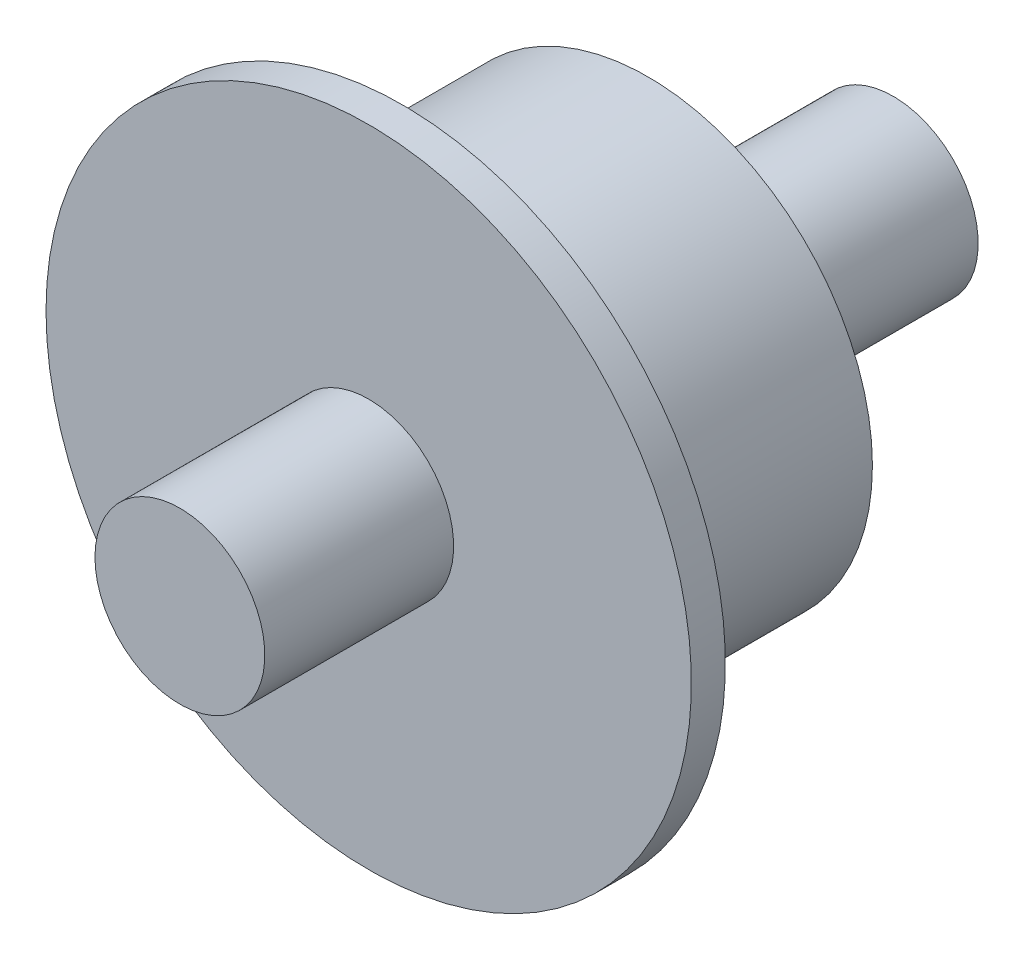
ISO-10303-21;
HEADER;
FILE_DESCRIPTION(('STEP AP214'),'2;1');
FILE_NAME('part.step','',(''),(''),'','','');
FILE_SCHEMA(('AUTOMOTIVE_DESIGN { 1 0 10303 214 1 1 1 1 }'));
ENDSEC;
DATA;
#1=APPLICATION_CONTEXT('core data for automotive mechanical design processes');
#2=APPLICATION_PROTOCOL_DEFINITION('international standard','automotive_design',2000,#1);
#3=PRODUCT_CONTEXT('',#1,'mechanical');
#4=PRODUCT('Part','Part','',(#3));
#5=PRODUCT_RELATED_PRODUCT_CATEGORY('part','',(#4));
#6=PRODUCT_DEFINITION_FORMATION('','',#4);
#7=PRODUCT_DEFINITION_CONTEXT('part definition',#1,'design');
#8=PRODUCT_DEFINITION('design','',#6,#7);
#9=PRODUCT_DEFINITION_SHAPE('','',#8);
#10=(LENGTH_UNIT() NAMED_UNIT(*) SI_UNIT(.MILLI.,.METRE.));
#11=(NAMED_UNIT(*) PLANE_ANGLE_UNIT() SI_UNIT($,.RADIAN.));
#12=(NAMED_UNIT(*) SI_UNIT($,.STERADIAN.) SOLID_ANGLE_UNIT());
#13=UNCERTAINTY_MEASURE_WITH_UNIT(LENGTH_MEASURE(1.E-05),#10,'distance_accuracy_value','');
#14=(GEOMETRIC_REPRESENTATION_CONTEXT(3) GLOBAL_UNCERTAINTY_ASSIGNED_CONTEXT((#13)) GLOBAL_UNIT_ASSIGNED_CONTEXT((#10,
#11,#12)) REPRESENTATION_CONTEXT('',''));
#15=CARTESIAN_POINT('',(0.,0.,0.));
#16=DIRECTION('',(0.,0.,1.));
#17=DIRECTION('',(1.,0.,0.));
#18=AXIS2_PLACEMENT_3D('',#15,#16,#17);
#19=CARTESIAN_POINT('',(0.,0.,23.1344262295082));
#20=DIRECTION('',(0.,0.,1.));
#21=DIRECTION('',(1.,0.,0.));
#22=AXIS2_PLACEMENT_3D('',#19,#20,#21);
#23=PLANE('',#22);
#24=CARTESIAN_POINT('',(0.,0.,23.1344262295082));
#25=DIRECTION('',(0.,0.,-1.));
#26=DIRECTION('',(-1.,0.,0.));
#27=AXIS2_PLACEMENT_3D('',#24,#25,#26);
#28=CIRCLE('',#27,4.99999999999999);
#29=CARTESIAN_POINT('',(-4.99999999999999,0.,23.1344262295082));
#30=VERTEX_POINT('',#29);
#31=EDGE_CURVE('E10',#30,#30,#28,.T.);
#32=ORIENTED_EDGE('',*,*,#31,.F.);
#33=EDGE_LOOP('',(#32));
#34=FACE_BOUND('',#33,.T.);
#35=ADVANCED_FACE('F37',(#34),#23,.T.);
#36=CARTESIAN_POINT('',(0.,0.,-18.8655737704918));
#37=DIRECTION('',(0.,0.,-1.));
#38=DIRECTION('',(-1.,0.,0.));
#39=AXIS2_PLACEMENT_3D('',#36,#37,#38);
#40=CYLINDRICAL_SURFACE('',#39,4.99999999999999);
#41=ORIENTED_EDGE('',*,*,#31,.T.);
#42=EDGE_LOOP('',(#41));
#43=FACE_BOUND('',#42,.T.);
#44=CARTESIAN_POINT('',(0.,0.,12.0163934746229));
#45=DIRECTION('',(0.,0.,-1.));
#46=DIRECTION('',(-1.,0.,0.));
#47=AXIS2_PLACEMENT_3D('',#44,#45,#46);
#48=CIRCLE('',#47,4.99999999999999);
#49=CARTESIAN_POINT('',(-4.99999999999999,0.,12.0163934746229));
#50=VERTEX_POINT('',#49);
#51=EDGE_CURVE('E43',#50,#50,#48,.T.);
#52=ORIENTED_EDGE('',*,*,#51,.F.);
#53=EDGE_LOOP('',(#52));
#54=FACE_BOUND('',#53,.T.);
#55=ADVANCED_FACE('F85',(#43,#54),#40,.T.);
#56=CARTESIAN_POINT('',(-19.,0.,12.0163934746229));
#57=DIRECTION('',(0.,0.,1.));
#58=DIRECTION('',(1.,0.,0.));
#59=AXIS2_PLACEMENT_3D('',#56,#57,#58);
#60=PLANE('',#59);
#61=ORIENTED_EDGE('',*,*,#51,.T.);
#62=EDGE_LOOP('',(#61));
#63=FACE_BOUND('',#62,.T.);
#64=CARTESIAN_POINT('',(0.,0.,12.0163934746229));
#65=DIRECTION('',(0.,0.,-1.));
#66=DIRECTION('',(-1.,0.,0.));
#67=AXIS2_PLACEMENT_3D('',#64,#65,#66);
#68=CIRCLE('',#67,19.);
#69=CARTESIAN_POINT('',(-19.,0.,12.0163934746229));
#70=VERTEX_POINT('',#69);
#71=EDGE_CURVE('E47',#70,#70,#68,.T.);
#72=ORIENTED_EDGE('',*,*,#71,.F.);
#73=EDGE_LOOP('',(#72));
#74=FACE_BOUND('',#73,.T.);
#75=ADVANCED_FACE('F90',(#63,#74),#60,.T.);
#76=CARTESIAN_POINT('',(0.,0.,-18.8655737704918));
#77=DIRECTION('',(0.,0.,-1.));
#78=DIRECTION('',(-1.,0.,0.));
#79=AXIS2_PLACEMENT_3D('',#76,#77,#78);
#80=CYLINDRICAL_SURFACE('',#79,19.);
#81=ORIENTED_EDGE('',*,*,#71,.T.);
#82=EDGE_LOOP('',(#81));
#83=FACE_BOUND('',#82,.T.);
#84=CARTESIAN_POINT('',(0.,0.,10.0163934106229));
#85=DIRECTION('',(0.,0.,-1.));
#86=DIRECTION('',(-1.,0.,0.));
#87=AXIS2_PLACEMENT_3D('',#84,#85,#86);
#88=CIRCLE('',#87,19.);
#89=CARTESIAN_POINT('',(-19.,0.,10.0163934106229));
#90=VERTEX_POINT('',#89);
#91=EDGE_CURVE('E51',#90,#90,#88,.T.);
#92=ORIENTED_EDGE('',*,*,#91,.F.);
#93=EDGE_LOOP('',(#92));
#94=FACE_BOUND('',#93,.T.);
#95=ADVANCED_FACE('F94',(#83,#94),#80,.T.);
#96=CARTESIAN_POINT('',(-13.2162624532378,0.,10.0163934106229));
#97=DIRECTION('',(0.,0.,-1.));
#98=DIRECTION('',(-1.,0.,0.));
#99=AXIS2_PLACEMENT_3D('',#96,#97,#98);
#100=PLANE('',#99);
#101=ORIENTED_EDGE('',*,*,#91,.T.);
#102=EDGE_LOOP('',(#101));
#103=FACE_BOUND('',#102,.T.);
#104=CARTESIAN_POINT('',(0.,0.,10.0163934106229));
#105=DIRECTION('',(0.,0.,-1.));
#106=DIRECTION('',(-1.,0.,0.));
#107=AXIS2_PLACEMENT_3D('',#104,#105,#106);
#108=CIRCLE('',#107,13.2162624532378);
#109=CARTESIAN_POINT('',(-13.2162624532378,0.,10.0163934106229));
#110=VERTEX_POINT('',#109);
#111=EDGE_CURVE('E56',#110,#110,#108,.T.);
#112=ORIENTED_EDGE('',*,*,#111,.F.);
#113=EDGE_LOOP('',(#112));
#114=FACE_BOUND('',#113,.T.);
#115=ADVANCED_FACE('F100',(#103,#114),#100,.T.);
#116=CARTESIAN_POINT('',(0.,0.,-18.8655737704918));
#117=DIRECTION('',(0.,0.,-1.));
#118=DIRECTION('',(-1.,0.,0.));
#119=AXIS2_PLACEMENT_3D('',#116,#117,#118);
#120=CYLINDRICAL_SURFACE('',#119,13.2162624532378);
#121=ORIENTED_EDGE('',*,*,#111,.T.);
#122=EDGE_LOOP('',(#121));
#123=FACE_BOUND('',#122,.T.);
#124=CARTESIAN_POINT('',(0.,0.,-4.42459017993444));
#125=DIRECTION('',(0.,0.,-1.));
#126=DIRECTION('',(-1.,0.,0.));
#127=AXIS2_PLACEMENT_3D('',#124,#125,#126);
#128=CIRCLE('',#127,13.2162624532378);
#129=CARTESIAN_POINT('',(-13.2162624532378,0.,-4.42459017993444));
#130=VERTEX_POINT('',#129);
#131=EDGE_CURVE('E59',#130,#130,#128,.T.);
#132=ORIENTED_EDGE('',*,*,#131,.F.);
#133=EDGE_LOOP('',(#132));
#134=FACE_BOUND('',#133,.T.);
#135=ADVANCED_FACE('F81',(#123,#134),#120,.T.);
#136=CARTESIAN_POINT('',(-5.,0.,-4.42459017993444));
#137=DIRECTION('',(0.,0.,-1.));
#138=DIRECTION('',(-1.,0.,0.));
#139=AXIS2_PLACEMENT_3D('',#136,#137,#138);
#140=PLANE('',#139);
#141=ORIENTED_EDGE('',*,*,#131,.T.);
#142=EDGE_LOOP('',(#141));
#143=FACE_BOUND('',#142,.T.);
#144=CARTESIAN_POINT('',(0.,0.,-4.42459017993444));
#145=DIRECTION('',(0.,0.,-1.));
#146=DIRECTION('',(-1.,0.,0.));
#147=AXIS2_PLACEMENT_3D('',#144,#145,#146);
#148=CIRCLE('',#147,5.);
#149=CARTESIAN_POINT('',(-5.,0.,-4.42459017993444));
#150=VERTEX_POINT('',#149);
#151=EDGE_CURVE('E62',#150,#150,#148,.T.);
#152=ORIENTED_EDGE('',*,*,#151,.F.);
#153=EDGE_LOOP('',(#152));
#154=FACE_BOUND('',#153,.T.);
#155=ADVANCED_FACE('F73',(#143,#154),#140,.T.);
#156=CARTESIAN_POINT('',(0.,0.,-18.8655737704918));
#157=DIRECTION('',(0.,0.,-1.));
#158=DIRECTION('',(-1.,0.,0.));
#159=AXIS2_PLACEMENT_3D('',#156,#157,#158);
#160=CYLINDRICAL_SURFACE('',#159,5.);
#161=ORIENTED_EDGE('',*,*,#151,.T.);
#162=EDGE_LOOP('',(#161));
#163=FACE_BOUND('',#162,.T.);
#164=CARTESIAN_POINT('',(0.,0.,-18.8655737704918));
#165=DIRECTION('',(0.,0.,-1.));
#166=DIRECTION('',(-1.,0.,0.));
#167=AXIS2_PLACEMENT_3D('',#164,#165,#166);
#168=CIRCLE('',#167,5.);
#169=CARTESIAN_POINT('',(-5.,0.,-18.8655737704918));
#170=VERTEX_POINT('',#169);
#171=EDGE_CURVE('E65',#170,#170,#168,.T.);
#172=ORIENTED_EDGE('',*,*,#171,.F.);
#173=EDGE_LOOP('',(#172));
#174=FACE_BOUND('',#173,.T.);
#175=ADVANCED_FACE('F71',(#163,#174),#160,.T.);
#176=CARTESIAN_POINT('',(-5.,0.,-18.8655737704918));
#177=DIRECTION('',(0.,0.,-1.));
#178=DIRECTION('',(-1.,0.,0.));
#179=AXIS2_PLACEMENT_3D('',#176,#177,#178);
#180=PLANE('',#179);
#181=ORIENTED_EDGE('',*,*,#171,.T.);
#182=EDGE_LOOP('',(#181));
#183=FACE_BOUND('',#182,.T.);
#184=ADVANCED_FACE('F69',(#183),#180,.T.);
#185=CLOSED_SHELL('',(#35,#55,#75,#95,#115,#135,#155,#175,#184));
#186=MANIFOLD_SOLID_BREP('B2',#185);
#187=ADVANCED_BREP_SHAPE_REPRESENTATION('',(#18,#186),#14);
#188=SHAPE_DEFINITION_REPRESENTATION(#9,#187);
ENDSEC;
END-ISO-10303-21;
